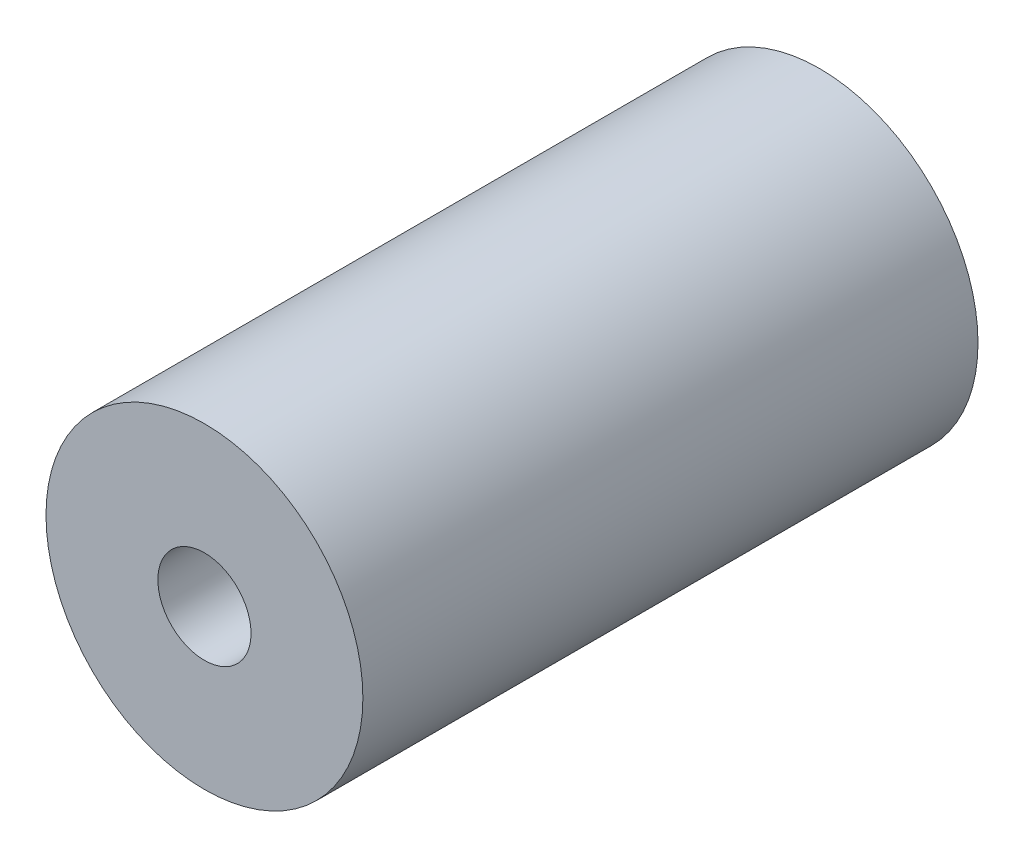
ISO-10303-21;
HEADER;
FILE_DESCRIPTION(('STEP AP214'),'2;1');
FILE_NAME('part.step','',(''),(''),'','','');
FILE_SCHEMA(('AUTOMOTIVE_DESIGN { 1 0 10303 214 1 1 1 1 }'));
ENDSEC;
DATA;
#1=APPLICATION_CONTEXT('core data for automotive mechanical design processes');
#2=APPLICATION_PROTOCOL_DEFINITION('international standard','automotive_design',2000,#1);
#3=PRODUCT_CONTEXT('',#1,'mechanical');
#4=PRODUCT('Part','Part','',(#3));
#5=PRODUCT_RELATED_PRODUCT_CATEGORY('part','',(#4));
#6=PRODUCT_DEFINITION_FORMATION('','',#4);
#7=PRODUCT_DEFINITION_CONTEXT('part definition',#1,'design');
#8=PRODUCT_DEFINITION('design','',#6,#7);
#9=PRODUCT_DEFINITION_SHAPE('','',#8);
#10=(LENGTH_UNIT() NAMED_UNIT(*) SI_UNIT(.MILLI.,.METRE.));
#11=(NAMED_UNIT(*) PLANE_ANGLE_UNIT() SI_UNIT($,.RADIAN.));
#12=(NAMED_UNIT(*) SI_UNIT($,.STERADIAN.) SOLID_ANGLE_UNIT());
#13=UNCERTAINTY_MEASURE_WITH_UNIT(LENGTH_MEASURE(1.E-05),#10,'distance_accuracy_value','');
#14=(GEOMETRIC_REPRESENTATION_CONTEXT(3) GLOBAL_UNCERTAINTY_ASSIGNED_CONTEXT((#13)) GLOBAL_UNIT_ASSIGNED_CONTEXT((#10,
#11,#12)) REPRESENTATION_CONTEXT('',''));
#15=CARTESIAN_POINT('',(0.,0.,0.));
#16=DIRECTION('',(0.,0.,1.));
#17=DIRECTION('',(1.,0.,0.));
#18=AXIS2_PLACEMENT_3D('',#15,#16,#17);
#19=CARTESIAN_POINT('',(0.,0.,33.));
#20=DIRECTION('',(0.,0.,1.));
#21=DIRECTION('',(1.,0.,0.));
#22=AXIS2_PLACEMENT_3D('',#19,#20,#21);
#23=PLANE('',#22);
#24=CARTESIAN_POINT('',(0.,0.,33.));
#25=DIRECTION('',(0.,0.,1.));
#26=DIRECTION('',(1.,0.,0.));
#27=AXIS2_PLACEMENT_3D('',#24,#25,#26);
#28=CIRCLE('',#27,17.);
#29=CARTESIAN_POINT('',(17.,0.,33.));
#30=VERTEX_POINT('',#29);
#31=EDGE_CURVE('E10',#30,#30,#28,.T.);
#32=ORIENTED_EDGE('',*,*,#31,.T.);
#33=EDGE_LOOP('',(#32));
#34=FACE_BOUND('',#33,.T.);
#35=CARTESIAN_POINT('',(0.,0.,33.));
#36=DIRECTION('',(0.,0.,1.));
#37=DIRECTION('',(1.,0.,0.));
#38=AXIS2_PLACEMENT_3D('',#35,#36,#37);
#39=CIRCLE('',#38,5.);
#40=CARTESIAN_POINT('',(5.,0.,33.));
#41=VERTEX_POINT('',#40);
#42=EDGE_CURVE('E50',#41,#41,#39,.T.);
#43=ORIENTED_EDGE('',*,*,#42,.F.);
#44=EDGE_LOOP('',(#43));
#45=FACE_BOUND('',#44,.T.);
#46=ADVANCED_FACE('F37',(#34,#45),#23,.T.);
#47=CARTESIAN_POINT('',(0.,0.,-33.));
#48=DIRECTION('',(0.,0.,1.));
#49=DIRECTION('',(1.,0.,0.));
#50=AXIS2_PLACEMENT_3D('',#47,#48,#49);
#51=PLANE('',#50);
#52=CARTESIAN_POINT('',(0.,0.,-33.));
#53=DIRECTION('',(0.,0.,1.));
#54=DIRECTION('',(1.,0.,0.));
#55=AXIS2_PLACEMENT_3D('',#52,#53,#54);
#56=CIRCLE('',#55,17.);
#57=CARTESIAN_POINT('',(17.,0.,-33.));
#58=VERTEX_POINT('',#57);
#59=EDGE_CURVE('E41',#58,#58,#56,.T.);
#60=ORIENTED_EDGE('',*,*,#59,.F.);
#61=EDGE_LOOP('',(#60));
#62=FACE_BOUND('',#61,.T.);
#63=CARTESIAN_POINT('',(0.,0.,-33.));
#64=DIRECTION('',(0.,0.,1.));
#65=DIRECTION('',(1.,0.,0.));
#66=AXIS2_PLACEMENT_3D('',#63,#64,#65);
#67=CIRCLE('',#66,5.);
#68=CARTESIAN_POINT('',(5.,0.,-33.));
#69=VERTEX_POINT('',#68);
#70=EDGE_CURVE('E52',#69,#69,#67,.T.);
#71=ORIENTED_EDGE('',*,*,#70,.T.);
#72=EDGE_LOOP('',(#71));
#73=FACE_BOUND('',#72,.T.);
#74=ADVANCED_FACE('F64',(#62,#73),#51,.F.);
#75=CARTESIAN_POINT('',(0.,0.,33.));
#76=DIRECTION('',(0.,0.,-1.));
#77=DIRECTION('',(-1.,0.,0.));
#78=AXIS2_PLACEMENT_3D('',#75,#76,#77);
#79=CYLINDRICAL_SURFACE('',#78,17.);
#80=ORIENTED_EDGE('',*,*,#31,.F.);
#81=EDGE_LOOP('',(#80));
#82=FACE_BOUND('',#81,.T.);
#83=ORIENTED_EDGE('',*,*,#59,.T.);
#84=EDGE_LOOP('',(#83));
#85=FACE_BOUND('',#84,.T.);
#86=ADVANCED_FACE('F39',(#82,#85),#79,.T.);
#87=CARTESIAN_POINT('',(0.,0.,33.));
#88=DIRECTION('',(0.,0.,-1.));
#89=DIRECTION('',(-1.,0.,0.));
#90=AXIS2_PLACEMENT_3D('',#87,#88,#89);
#91=CYLINDRICAL_SURFACE('',#90,5.);
#92=ORIENTED_EDGE('',*,*,#42,.T.);
#93=EDGE_LOOP('',(#92));
#94=FACE_BOUND('',#93,.T.);
#95=ORIENTED_EDGE('',*,*,#70,.F.);
#96=EDGE_LOOP('',(#95));
#97=FACE_BOUND('',#96,.T.);
#98=ADVANCED_FACE('F60',(#94,#97),#91,.F.);
#99=CLOSED_SHELL('',(#46,#74,#86,#98));
#100=MANIFOLD_SOLID_BREP('B2',#99);
#101=ADVANCED_BREP_SHAPE_REPRESENTATION('',(#18,#100),#14);
#102=SHAPE_DEFINITION_REPRESENTATION(#9,#101);
ENDSEC;
END-ISO-10303-21;
